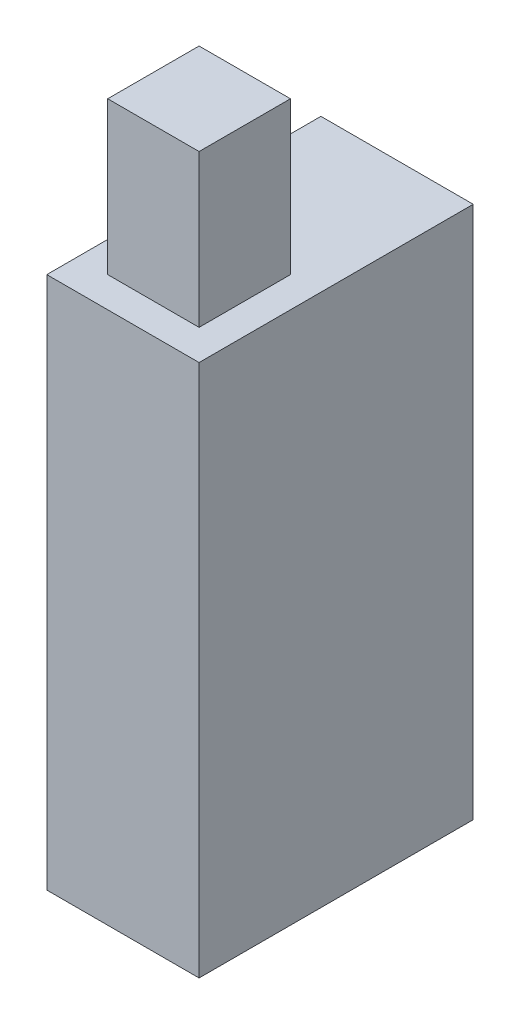
ISO-10303-21;
HEADER;
FILE_DESCRIPTION(('STEP AP214'),'2;1');
FILE_NAME('part.step','',(''),(''),'','','');
FILE_SCHEMA(('AUTOMOTIVE_DESIGN { 1 0 10303 214 1 1 1 1 }'));
ENDSEC;
DATA;
#1=APPLICATION_CONTEXT('core data for automotive mechanical design processes');
#2=APPLICATION_PROTOCOL_DEFINITION('international standard','automotive_design',2000,#1);
#3=PRODUCT_CONTEXT('',#1,'mechanical');
#4=PRODUCT('Part','Part','',(#3));
#5=PRODUCT_RELATED_PRODUCT_CATEGORY('part','',(#4));
#6=PRODUCT_DEFINITION_FORMATION('','',#4);
#7=PRODUCT_DEFINITION_CONTEXT('part definition',#1,'design');
#8=PRODUCT_DEFINITION('design','',#6,#7);
#9=PRODUCT_DEFINITION_SHAPE('','',#8);
#10=(LENGTH_UNIT() NAMED_UNIT(*) SI_UNIT(.MILLI.,.METRE.));
#11=(NAMED_UNIT(*) PLANE_ANGLE_UNIT() SI_UNIT($,.RADIAN.));
#12=(NAMED_UNIT(*) SI_UNIT($,.STERADIAN.) SOLID_ANGLE_UNIT());
#13=UNCERTAINTY_MEASURE_WITH_UNIT(LENGTH_MEASURE(1.E-05),#10,'distance_accuracy_value','');
#14=(GEOMETRIC_REPRESENTATION_CONTEXT(3) GLOBAL_UNCERTAINTY_ASSIGNED_CONTEXT((#13)) GLOBAL_UNIT_ASSIGNED_CONTEXT((#10,
#11,#12)) REPRESENTATION_CONTEXT('',''));
#15=CARTESIAN_POINT('',(0.,0.,0.));
#16=DIRECTION('',(0.,0.,1.));
#17=DIRECTION('',(1.,0.,0.));
#18=AXIS2_PLACEMENT_3D('',#15,#16,#17);
#19=CARTESIAN_POINT('',(0.,70.,0.));
#20=DIRECTION('',(0.,-1.,0.));
#21=DIRECTION('',(0.,0.,-1.));
#22=AXIS2_PLACEMENT_3D('',#19,#20,#21);
#23=PLANE('',#22);
#24=DIRECTION('',(0.,0.,-1.));
#25=VECTOR('',#24,1.);
#26=CARTESIAN_POINT('',(10.,70.,18.));
#27=LINE('',#26,#25);
#28=CARTESIAN_POINT('',(10.,70.,18.));
#29=VERTEX_POINT('',#28);
#30=CARTESIAN_POINT('',(10.,70.,-18.));
#31=VERTEX_POINT('',#30);
#32=EDGE_CURVE('E128',#29,#31,#27,.T.);
#33=ORIENTED_EDGE('',*,*,#32,.T.);
#34=DIRECTION('',(-1.,0.,0.));
#35=VECTOR('',#34,1.);
#36=CARTESIAN_POINT('',(-10.,70.,-18.));
#37=LINE('',#36,#35);
#38=CARTESIAN_POINT('',(-10.,70.,-18.));
#39=VERTEX_POINT('',#38);
#40=EDGE_CURVE('E131',#31,#39,#37,.T.);
#41=ORIENTED_EDGE('',*,*,#40,.T.);
#42=DIRECTION('',(0.,0.,1.));
#43=VECTOR('',#42,1.);
#44=CARTESIAN_POINT('',(-10.,70.,18.));
#45=LINE('',#44,#43);
#46=CARTESIAN_POINT('',(-10.,70.,18.));
#47=VERTEX_POINT('',#46);
#48=EDGE_CURVE('E134',#39,#47,#45,.T.);
#49=ORIENTED_EDGE('',*,*,#48,.T.);
#50=DIRECTION('',(1.,0.,0.));
#51=VECTOR('',#50,1.);
#52=CARTESIAN_POINT('',(-10.,70.,18.));
#53=LINE('',#52,#51);
#54=EDGE_CURVE('E136',#47,#29,#53,.T.);
#55=ORIENTED_EDGE('',*,*,#54,.T.);
#56=EDGE_LOOP('',(#33,#41,#49,#55));
#57=FACE_BOUND('',#56,.T.);
#58=DIRECTION('',(0.,0.,-1.));
#59=VECTOR('',#58,1.);
#60=CARTESIAN_POINT('',(6.,70.,14.));
#61=LINE('',#60,#59);
#62=CARTESIAN_POINT('',(6.,70.,14.));
#63=VERTEX_POINT('',#62);
#64=CARTESIAN_POINT('',(6.,70.,2.));
#65=VERTEX_POINT('',#64);
#66=EDGE_CURVE('E118',#63,#65,#61,.T.);
#67=ORIENTED_EDGE('',*,*,#66,.F.);
#68=DIRECTION('',(1.,0.,0.));
#69=VECTOR('',#68,1.);
#70=CARTESIAN_POINT('',(-6.,70.,14.));
#71=LINE('',#70,#69);
#72=CARTESIAN_POINT('',(-6.,70.,14.));
#73=VERTEX_POINT('',#72);
#74=EDGE_CURVE('E115',#73,#63,#71,.T.);
#75=ORIENTED_EDGE('',*,*,#74,.F.);
#76=DIRECTION('',(0.,0.,1.));
#77=VECTOR('',#76,1.);
#78=CARTESIAN_POINT('',(-6.,70.,14.));
#79=LINE('',#78,#77);
#80=CARTESIAN_POINT('',(-6.,70.,2.));
#81=VERTEX_POINT('',#80);
#82=EDGE_CURVE('E53',#81,#73,#79,.T.);
#83=ORIENTED_EDGE('',*,*,#82,.F.);
#84=DIRECTION('',(-1.,0.,0.));
#85=VECTOR('',#84,1.);
#86=CARTESIAN_POINT('',(-6.,70.,2.));
#87=LINE('',#86,#85);
#88=EDGE_CURVE('E48',#65,#81,#87,.T.);
#89=ORIENTED_EDGE('',*,*,#88,.F.);
#90=EDGE_LOOP('',(#67,#75,#83,#89));
#91=FACE_BOUND('',#90,.T.);
#92=ADVANCED_FACE('F33',(#57,#91),#23,.F.);
#93=CARTESIAN_POINT('',(10.,70.,18.));
#94=DIRECTION('',(-1.,0.,0.));
#95=DIRECTION('',(0.,0.,1.));
#96=AXIS2_PLACEMENT_3D('',#93,#94,#95);
#97=PLANE('',#96);
#98=DIRECTION('',(0.,0.,-1.));
#99=VECTOR('',#98,1.);
#100=CARTESIAN_POINT('',(10.,0.,18.));
#101=LINE('',#100,#99);
#102=CARTESIAN_POINT('',(10.,0.,18.));
#103=VERTEX_POINT('',#102);
#104=CARTESIAN_POINT('',(10.,0.,-18.));
#105=VERTEX_POINT('',#104);
#106=EDGE_CURVE('E119',#103,#105,#101,.T.);
#107=ORIENTED_EDGE('',*,*,#106,.T.);
#108=DIRECTION('',(0.,-1.,0.));
#109=VECTOR('',#108,1.);
#110=CARTESIAN_POINT('',(10.,70.,-18.));
#111=LINE('',#110,#109);
#112=EDGE_CURVE('E11',#31,#105,#111,.T.);
#113=ORIENTED_EDGE('',*,*,#112,.F.);
#114=ORIENTED_EDGE('',*,*,#32,.F.);
#115=DIRECTION('',(0.,-1.,0.));
#116=VECTOR('',#115,1.);
#117=CARTESIAN_POINT('',(10.,70.,18.));
#118=LINE('',#117,#116);
#119=EDGE_CURVE('E137',#29,#103,#118,.T.);
#120=ORIENTED_EDGE('',*,*,#119,.T.);
#121=EDGE_LOOP('',(#107,#113,#114,#120));
#122=FACE_BOUND('',#121,.T.);
#123=ADVANCED_FACE('F35',(#122),#97,.F.);
#124=CARTESIAN_POINT('',(-10.,70.,-18.));
#125=DIRECTION('',(0.,0.,1.));
#126=DIRECTION('',(1.,0.,0.));
#127=AXIS2_PLACEMENT_3D('',#124,#125,#126);
#128=PLANE('',#127);
#129=DIRECTION('',(-1.,0.,0.));
#130=VECTOR('',#129,1.);
#131=CARTESIAN_POINT('',(-10.,0.,-18.));
#132=LINE('',#131,#130);
#133=CARTESIAN_POINT('',(-10.,0.,-18.));
#134=VERTEX_POINT('',#133);
#135=EDGE_CURVE('E122',#105,#134,#132,.T.);
#136=ORIENTED_EDGE('',*,*,#135,.T.);
#137=DIRECTION('',(0.,-1.,0.));
#138=VECTOR('',#137,1.);
#139=CARTESIAN_POINT('',(-10.,70.,-18.));
#140=LINE('',#139,#138);
#141=EDGE_CURVE('E41',#39,#134,#140,.T.);
#142=ORIENTED_EDGE('',*,*,#141,.F.);
#143=ORIENTED_EDGE('',*,*,#40,.F.);
#144=ORIENTED_EDGE('',*,*,#112,.T.);
#145=EDGE_LOOP('',(#136,#142,#143,#144));
#146=FACE_BOUND('',#145,.T.);
#147=ADVANCED_FACE('F167',(#146),#128,.F.);
#148=CARTESIAN_POINT('',(-10.,70.,18.));
#149=DIRECTION('',(1.,0.,0.));
#150=DIRECTION('',(0.,0.,-1.));
#151=AXIS2_PLACEMENT_3D('',#148,#149,#150);
#152=PLANE('',#151);
#153=DIRECTION('',(0.,0.,1.));
#154=VECTOR('',#153,1.);
#155=CARTESIAN_POINT('',(-10.,0.,18.));
#156=LINE('',#155,#154);
#157=CARTESIAN_POINT('',(-10.,0.,18.));
#158=VERTEX_POINT('',#157);
#159=EDGE_CURVE('E140',#134,#158,#156,.T.);
#160=ORIENTED_EDGE('',*,*,#159,.T.);
#161=DIRECTION('',(0.,-1.,0.));
#162=VECTOR('',#161,1.);
#163=CARTESIAN_POINT('',(-10.,70.,18.));
#164=LINE('',#163,#162);
#165=EDGE_CURVE('E145',#47,#158,#164,.T.);
#166=ORIENTED_EDGE('',*,*,#165,.F.);
#167=ORIENTED_EDGE('',*,*,#48,.F.);
#168=ORIENTED_EDGE('',*,*,#141,.T.);
#169=EDGE_LOOP('',(#160,#166,#167,#168));
#170=FACE_BOUND('',#169,.T.);
#171=ADVANCED_FACE('F152',(#170),#152,.F.);
#172=CARTESIAN_POINT('',(-10.,70.,18.));
#173=DIRECTION('',(0.,0.,-1.));
#174=DIRECTION('',(-1.,0.,0.));
#175=AXIS2_PLACEMENT_3D('',#172,#173,#174);
#176=PLANE('',#175);
#177=DIRECTION('',(1.,0.,0.));
#178=VECTOR('',#177,1.);
#179=CARTESIAN_POINT('',(-10.,0.,18.));
#180=LINE('',#179,#178);
#181=EDGE_CURVE('E132',#158,#103,#180,.T.);
#182=ORIENTED_EDGE('',*,*,#181,.T.);
#183=ORIENTED_EDGE('',*,*,#119,.F.);
#184=ORIENTED_EDGE('',*,*,#54,.F.);
#185=ORIENTED_EDGE('',*,*,#165,.T.);
#186=EDGE_LOOP('',(#182,#183,#184,#185));
#187=FACE_BOUND('',#186,.T.);
#188=ADVANCED_FACE('F161',(#187),#176,.F.);
#189=CARTESIAN_POINT('',(0.,0.,0.));
#190=DIRECTION('',(0.,-1.,0.));
#191=DIRECTION('',(0.,0.,-1.));
#192=AXIS2_PLACEMENT_3D('',#189,#190,#191);
#193=PLANE('',#192);
#194=ORIENTED_EDGE('',*,*,#106,.F.);
#195=ORIENTED_EDGE('',*,*,#181,.F.);
#196=ORIENTED_EDGE('',*,*,#159,.F.);
#197=ORIENTED_EDGE('',*,*,#135,.F.);
#198=EDGE_LOOP('',(#194,#195,#196,#197));
#199=FACE_BOUND('',#198,.T.);
#200=ADVANCED_FACE('F158',(#199),#193,.T.);
#201=CARTESIAN_POINT('',(6.,90.,14.));
#202=DIRECTION('',(-1.,0.,0.));
#203=DIRECTION('',(0.,0.,1.));
#204=AXIS2_PLACEMENT_3D('',#201,#202,#203);
#205=PLANE('',#204);
#206=ORIENTED_EDGE('',*,*,#66,.T.);
#207=DIRECTION('',(0.,-1.,0.));
#208=VECTOR('',#207,1.);
#209=CARTESIAN_POINT('',(6.,90.,2.));
#210=LINE('',#209,#208);
#211=CARTESIAN_POINT('',(6.,90.,2.));
#212=VERTEX_POINT('',#211);
#213=EDGE_CURVE('E99',#212,#65,#210,.T.);
#214=ORIENTED_EDGE('',*,*,#213,.F.);
#215=DIRECTION('',(0.,0.,-1.));
#216=VECTOR('',#215,1.);
#217=CARTESIAN_POINT('',(6.,90.,14.));
#218=LINE('',#217,#216);
#219=CARTESIAN_POINT('',(6.,90.,14.));
#220=VERTEX_POINT('',#219);
#221=EDGE_CURVE('E106',#220,#212,#218,.T.);
#222=ORIENTED_EDGE('',*,*,#221,.F.);
#223=DIRECTION('',(0.,-1.,0.));
#224=VECTOR('',#223,1.);
#225=CARTESIAN_POINT('',(6.,90.,14.));
#226=LINE('',#225,#224);
#227=EDGE_CURVE('E260',#220,#63,#226,.T.);
#228=ORIENTED_EDGE('',*,*,#227,.T.);
#229=EDGE_LOOP('',(#206,#214,#222,#228));
#230=FACE_BOUND('',#229,.T.);
#231=ADVANCED_FACE('F117',(#230),#205,.F.);
#232=CARTESIAN_POINT('',(-6.,90.,2.));
#233=DIRECTION('',(0.,0.,1.));
#234=DIRECTION('',(1.,0.,0.));
#235=AXIS2_PLACEMENT_3D('',#232,#233,#234);
#236=PLANE('',#235);
#237=ORIENTED_EDGE('',*,*,#88,.T.);
#238=DIRECTION('',(0.,-1.,0.));
#239=VECTOR('',#238,1.);
#240=CARTESIAN_POINT('',(-6.,90.,2.));
#241=LINE('',#240,#239);
#242=CARTESIAN_POINT('',(-6.,90.,2.));
#243=VERTEX_POINT('',#242);
#244=EDGE_CURVE('E102',#243,#81,#241,.T.);
#245=ORIENTED_EDGE('',*,*,#244,.F.);
#246=DIRECTION('',(-1.,0.,0.));
#247=VECTOR('',#246,1.);
#248=CARTESIAN_POINT('',(-6.,90.,2.));
#249=LINE('',#248,#247);
#250=EDGE_CURVE('E95',#212,#243,#249,.T.);
#251=ORIENTED_EDGE('',*,*,#250,.F.);
#252=ORIENTED_EDGE('',*,*,#213,.T.);
#253=EDGE_LOOP('',(#237,#245,#251,#252));
#254=FACE_BOUND('',#253,.T.);
#255=ADVANCED_FACE('F97',(#254),#236,.F.);
#256=CARTESIAN_POINT('',(-6.,90.,14.));
#257=DIRECTION('',(1.,0.,0.));
#258=DIRECTION('',(0.,0.,-1.));
#259=AXIS2_PLACEMENT_3D('',#256,#257,#258);
#260=PLANE('',#259);
#261=ORIENTED_EDGE('',*,*,#82,.T.);
#262=DIRECTION('',(0.,-1.,0.));
#263=VECTOR('',#262,1.);
#264=CARTESIAN_POINT('',(-6.,90.,14.));
#265=LINE('',#264,#263);
#266=CARTESIAN_POINT('',(-6.,90.,14.));
#267=VERTEX_POINT('',#266);
#268=EDGE_CURVE('E124',#267,#73,#265,.T.);
#269=ORIENTED_EDGE('',*,*,#268,.F.);
#270=DIRECTION('',(0.,0.,1.));
#271=VECTOR('',#270,1.);
#272=CARTESIAN_POINT('',(-6.,90.,14.));
#273=LINE('',#272,#271);
#274=EDGE_CURVE('E105',#243,#267,#273,.T.);
#275=ORIENTED_EDGE('',*,*,#274,.F.);
#276=ORIENTED_EDGE('',*,*,#244,.T.);
#277=EDGE_LOOP('',(#261,#269,#275,#276));
#278=FACE_BOUND('',#277,.T.);
#279=ADVANCED_FACE('F203',(#278),#260,.F.);
#280=CARTESIAN_POINT('',(-6.,90.,14.));
#281=DIRECTION('',(0.,0.,-1.));
#282=DIRECTION('',(-1.,0.,0.));
#283=AXIS2_PLACEMENT_3D('',#280,#281,#282);
#284=PLANE('',#283);
#285=ORIENTED_EDGE('',*,*,#74,.T.);
#286=ORIENTED_EDGE('',*,*,#227,.F.);
#287=DIRECTION('',(1.,0.,0.));
#288=VECTOR('',#287,1.);
#289=CARTESIAN_POINT('',(-6.,90.,14.));
#290=LINE('',#289,#288);
#291=EDGE_CURVE('E111',#267,#220,#290,.T.);
#292=ORIENTED_EDGE('',*,*,#291,.F.);
#293=ORIENTED_EDGE('',*,*,#268,.T.);
#294=EDGE_LOOP('',(#285,#286,#292,#293));
#295=FACE_BOUND('',#294,.T.);
#296=ADVANCED_FACE('F209',(#295),#284,.F.);
#297=CARTESIAN_POINT('',(0.,90.,0.));
#298=DIRECTION('',(0.,-1.,0.));
#299=DIRECTION('',(0.,0.,-1.));
#300=AXIS2_PLACEMENT_3D('',#297,#298,#299);
#301=PLANE('',#300);
#302=ORIENTED_EDGE('',*,*,#221,.T.);
#303=ORIENTED_EDGE('',*,*,#250,.T.);
#304=ORIENTED_EDGE('',*,*,#274,.T.);
#305=ORIENTED_EDGE('',*,*,#291,.T.);
#306=EDGE_LOOP('',(#302,#303,#304,#305));
#307=FACE_BOUND('',#306,.T.);
#308=ADVANCED_FACE('F109',(#307),#301,.F.);
#309=CLOSED_SHELL('',(#92,#123,#147,#171,#188,#200,#231,#255,#279,#296,#308));
#310=MANIFOLD_SOLID_BREP('B2',#309);
#311=ADVANCED_BREP_SHAPE_REPRESENTATION('',(#18,#310),#14);
#312=SHAPE_DEFINITION_REPRESENTATION(#9,#311);
ENDSEC;
END-ISO-10303-21;
